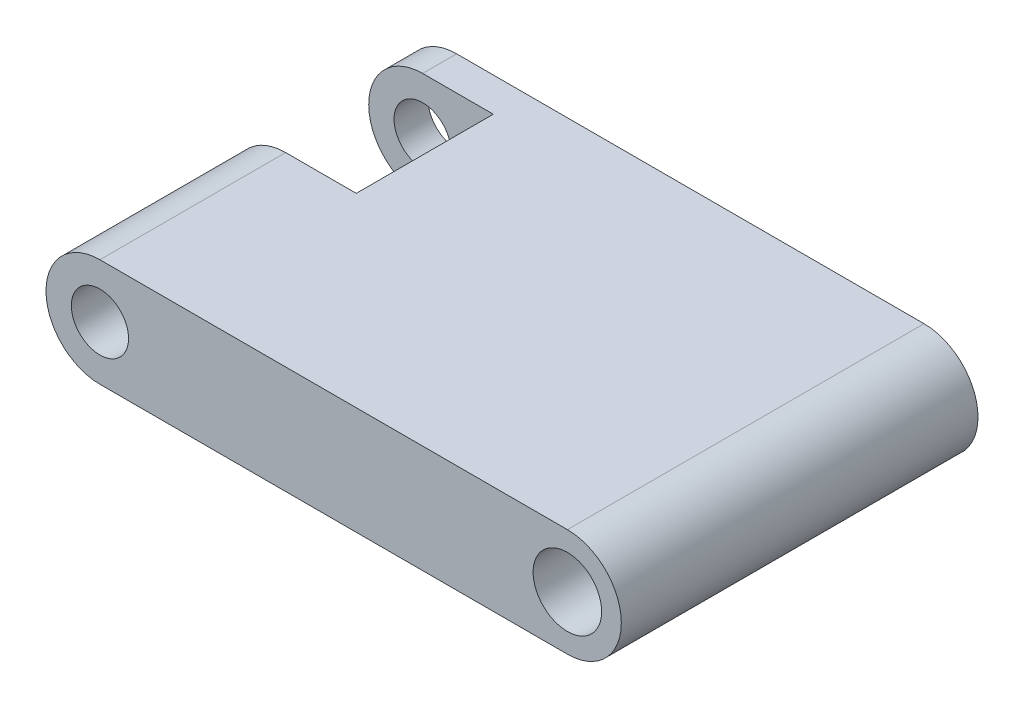
ISO-10303-21;
HEADER;
FILE_DESCRIPTION(('STEP AP214'),'2;1');
FILE_NAME('part.step','',(''),(''),'','','');
FILE_SCHEMA(('AUTOMOTIVE_DESIGN { 1 0 10303 214 1 1 1 1 }'));
ENDSEC;
DATA;
#1=APPLICATION_CONTEXT('core data for automotive mechanical design processes');
#2=APPLICATION_PROTOCOL_DEFINITION('international standard','automotive_design',2000,#1);
#3=PRODUCT_CONTEXT('',#1,'mechanical');
#4=PRODUCT('Part','Part','',(#3));
#5=PRODUCT_RELATED_PRODUCT_CATEGORY('part','',(#4));
#6=PRODUCT_DEFINITION_FORMATION('','',#4);
#7=PRODUCT_DEFINITION_CONTEXT('part definition',#1,'design');
#8=PRODUCT_DEFINITION('design','',#6,#7);
#9=PRODUCT_DEFINITION_SHAPE('','',#8);
#10=(LENGTH_UNIT() NAMED_UNIT(*) SI_UNIT(.MILLI.,.METRE.));
#11=(NAMED_UNIT(*) PLANE_ANGLE_UNIT() SI_UNIT($,.RADIAN.));
#12=(NAMED_UNIT(*) SI_UNIT($,.STERADIAN.) SOLID_ANGLE_UNIT());
#13=UNCERTAINTY_MEASURE_WITH_UNIT(LENGTH_MEASURE(1.E-05),#10,'distance_accuracy_value','');
#14=(GEOMETRIC_REPRESENTATION_CONTEXT(3) GLOBAL_UNCERTAINTY_ASSIGNED_CONTEXT((#13)) GLOBAL_UNIT_ASSIGNED_CONTEXT((#10,
#11,#12)) REPRESENTATION_CONTEXT('',''));
#15=CARTESIAN_POINT('',(0.,0.,0.));
#16=DIRECTION('',(0.,0.,1.));
#17=DIRECTION('',(1.,0.,0.));
#18=AXIS2_PLACEMENT_3D('',#15,#16,#17);
#19=CARTESIAN_POINT('',(-20.6375,0.,15.748));
#20=DIRECTION('',(0.,0.,-1.));
#21=DIRECTION('',(-1.,0.,0.));
#22=AXIS2_PLACEMENT_3D('',#19,#20,#21);
#23=CYLINDRICAL_SURFACE('',#22,4.76249999999999);
#24=CARTESIAN_POINT('',(-20.6375,0.,-12.748));
#25=DIRECTION('',(0.,0.,-1.));
#26=DIRECTION('',(-1.,0.,0.));
#27=AXIS2_PLACEMENT_3D('',#24,#25,#26);
#28=CIRCLE('',#27,4.76249999999999);
#29=CARTESIAN_POINT('',(-20.6375,-4.76249999999999,-12.748));
#30=VERTEX_POINT('',#29);
#31=CARTESIAN_POINT('',(-20.6375,4.76249999999999,-12.748));
#32=VERTEX_POINT('',#31);
#33=EDGE_CURVE('E148',#30,#32,#28,.T.);
#34=ORIENTED_EDGE('',*,*,#33,.T.);
#35=DIRECTION('',(0.,0.,-1.));
#36=VECTOR('',#35,1.);
#37=CARTESIAN_POINT('',(-20.6375,4.76249999999999,15.748));
#38=LINE('',#37,#36);
#39=CARTESIAN_POINT('',(-20.6375,4.76249999999999,-15.748));
#40=VERTEX_POINT('',#39);
#41=EDGE_CURVE('E86',#32,#40,#38,.T.);
#42=ORIENTED_EDGE('',*,*,#41,.T.);
#43=CARTESIAN_POINT('',(-20.6375,0.,-15.748));
#44=DIRECTION('',(0.,0.,1.));
#45=DIRECTION('',(1.,0.,0.));
#46=AXIS2_PLACEMENT_3D('',#43,#44,#45);
#47=CIRCLE('',#46,4.76249999999999);
#48=CARTESIAN_POINT('',(-20.6375,-4.76249999999999,-15.748));
#49=VERTEX_POINT('',#48);
#50=EDGE_CURVE('E165',#40,#49,#47,.T.);
#51=ORIENTED_EDGE('',*,*,#50,.T.);
#52=DIRECTION('',(0.,0.,-1.));
#53=VECTOR('',#52,1.);
#54=CARTESIAN_POINT('',(-20.6375,-4.76249999999999,15.748));
#55=LINE('',#54,#53);
#56=EDGE_CURVE('E202',#30,#49,#55,.T.);
#57=ORIENTED_EDGE('',*,*,#56,.F.);
#58=EDGE_LOOP('',(#34,#42,#51,#57));
#59=FACE_BOUND('',#58,.T.);
#60=ADVANCED_FACE('F39',(#59),#23,.T.);
#61=CARTESIAN_POINT('',(-20.6375,0.,15.748));
#62=DIRECTION('',(0.,0.,-1.));
#63=DIRECTION('',(-1.,0.,0.));
#64=AXIS2_PLACEMENT_3D('',#61,#62,#63);
#65=CYLINDRICAL_SURFACE('',#64,2.525);
#66=CARTESIAN_POINT('',(-20.6375,0.,-12.748));
#67=DIRECTION('',(0.,0.,-1.));
#68=DIRECTION('',(-1.,0.,0.));
#69=AXIS2_PLACEMENT_3D('',#66,#67,#68);
#70=CIRCLE('',#69,2.525);
#71=CARTESIAN_POINT('',(-23.1625,0.,-12.748));
#72=VERTEX_POINT('',#71);
#73=EDGE_CURVE('E136',#72,#72,#70,.T.);
#74=ORIENTED_EDGE('',*,*,#73,.F.);
#75=EDGE_LOOP('',(#74));
#76=FACE_BOUND('',#75,.T.);
#77=CARTESIAN_POINT('',(-20.6375,0.,-15.748));
#78=DIRECTION('',(0.,0.,1.));
#79=DIRECTION('',(1.,0.,0.));
#80=AXIS2_PLACEMENT_3D('',#77,#78,#79);
#81=CIRCLE('',#80,2.525);
#82=CARTESIAN_POINT('',(-18.1125,0.,-15.748));
#83=VERTEX_POINT('',#82);
#84=EDGE_CURVE('E157',#83,#83,#81,.T.);
#85=ORIENTED_EDGE('',*,*,#84,.F.);
#86=EDGE_LOOP('',(#85));
#87=FACE_BOUND('',#86,.T.);
#88=ADVANCED_FACE('F229',(#76,#87),#65,.F.);
#89=CARTESIAN_POINT('',(-20.6375,0.,15.748));
#90=DIRECTION('',(0.,0.,1.));
#91=DIRECTION('',(1.,0.,0.));
#92=AXIS2_PLACEMENT_3D('',#89,#90,#91);
#93=PLANE('',#92);
#94=CARTESIAN_POINT('',(-20.6375,0.,15.748));
#95=DIRECTION('',(0.,0.,1.));
#96=DIRECTION('',(1.,0.,0.));
#97=AXIS2_PLACEMENT_3D('',#94,#95,#96);
#98=CIRCLE('',#97,2.525);
#99=CARTESIAN_POINT('',(-18.1125,0.,15.748));
#100=VERTEX_POINT('',#99);
#101=EDGE_CURVE('E161',#100,#100,#98,.T.);
#102=ORIENTED_EDGE('',*,*,#101,.F.);
#103=EDGE_LOOP('',(#102));
#104=FACE_BOUND('',#103,.T.);
#105=CARTESIAN_POINT('',(-20.6375,0.,15.748));
#106=DIRECTION('',(0.,0.,1.));
#107=DIRECTION('',(1.,0.,0.));
#108=AXIS2_PLACEMENT_3D('',#105,#106,#107);
#109=CIRCLE('',#108,4.76249999999999);
#110=CARTESIAN_POINT('',(-20.6375,4.76249999999999,15.748));
#111=VERTEX_POINT('',#110);
#112=CARTESIAN_POINT('',(-20.6375,-4.76249999999999,15.748));
#113=VERTEX_POINT('',#112);
#114=EDGE_CURVE('E169',#111,#113,#109,.T.);
#115=ORIENTED_EDGE('',*,*,#114,.T.);
#116=DIRECTION('',(1.,0.,0.));
#117=VECTOR('',#116,1.);
#118=CARTESIAN_POINT('',(-20.6375,-4.76249999999999,15.748));
#119=LINE('',#118,#117);
#120=CARTESIAN_POINT('',(20.6375,-4.76249999999999,15.748));
#121=VERTEX_POINT('',#120);
#122=EDGE_CURVE('E94',#113,#121,#119,.T.);
#123=ORIENTED_EDGE('',*,*,#122,.T.);
#124=CARTESIAN_POINT('',(20.6375,0.,15.748));
#125=DIRECTION('',(0.,0.,1.));
#126=DIRECTION('',(1.,0.,0.));
#127=AXIS2_PLACEMENT_3D('',#124,#125,#126);
#128=CIRCLE('',#127,4.76249999999999);
#129=CARTESIAN_POINT('',(20.6375,4.76249999999999,15.748));
#130=VERTEX_POINT('',#129);
#131=EDGE_CURVE('E175',#121,#130,#128,.T.);
#132=ORIENTED_EDGE('',*,*,#131,.T.);
#133=DIRECTION('',(-1.,0.,0.));
#134=VECTOR('',#133,1.);
#135=CARTESIAN_POINT('',(-20.6375,4.76249999999999,15.748));
#136=LINE('',#135,#134);
#137=EDGE_CURVE('E64',#130,#111,#136,.T.);
#138=ORIENTED_EDGE('',*,*,#137,.T.);
#139=EDGE_LOOP('',(#115,#123,#132,#138));
#140=FACE_BOUND('',#139,.T.);
#141=CARTESIAN_POINT('',(20.6375,0.,15.748));
#142=DIRECTION('',(0.,0.,1.));
#143=DIRECTION('',(1.,0.,0.));
#144=AXIS2_PLACEMENT_3D('',#141,#142,#143);
#145=CIRCLE('',#144,3.025);
#146=CARTESIAN_POINT('',(23.6625,0.,15.748));
#147=VERTEX_POINT('',#146);
#148=EDGE_CURVE('E153',#147,#147,#145,.T.);
#149=ORIENTED_EDGE('',*,*,#148,.F.);
#150=EDGE_LOOP('',(#149));
#151=FACE_BOUND('',#150,.T.);
#152=ADVANCED_FACE('F233',(#104,#140,#151),#93,.T.);
#153=CARTESIAN_POINT('',(-20.6375,0.,-15.748));
#154=DIRECTION('',(0.,0.,1.));
#155=DIRECTION('',(1.,0.,0.));
#156=AXIS2_PLACEMENT_3D('',#153,#154,#155);
#157=PLANE('',#156);
#158=ORIENTED_EDGE('',*,*,#50,.F.);
#159=DIRECTION('',(-1.,0.,0.));
#160=VECTOR('',#159,1.);
#161=CARTESIAN_POINT('',(-20.6375,4.76249999999999,-15.748));
#162=LINE('',#161,#160);
#163=CARTESIAN_POINT('',(20.6375,4.76249999999999,-15.748));
#164=VERTEX_POINT('',#163);
#165=EDGE_CURVE('E172',#164,#40,#162,.T.);
#166=ORIENTED_EDGE('',*,*,#165,.F.);
#167=CARTESIAN_POINT('',(20.6375,0.,-15.748));
#168=DIRECTION('',(0.,0.,1.));
#169=DIRECTION('',(1.,0.,0.));
#170=AXIS2_PLACEMENT_3D('',#167,#168,#169);
#171=CIRCLE('',#170,4.76249999999999);
#172=CARTESIAN_POINT('',(20.6375,-4.76249999999999,-15.748));
#173=VERTEX_POINT('',#172);
#174=EDGE_CURVE('E185',#173,#164,#171,.T.);
#175=ORIENTED_EDGE('',*,*,#174,.F.);
#176=DIRECTION('',(1.,0.,0.));
#177=VECTOR('',#176,1.);
#178=CARTESIAN_POINT('',(-20.6375,-4.76249999999999,-15.748));
#179=LINE('',#178,#177);
#180=EDGE_CURVE('E182',#49,#173,#179,.T.);
#181=ORIENTED_EDGE('',*,*,#180,.F.);
#182=EDGE_LOOP('',(#158,#166,#175,#181));
#183=FACE_BOUND('',#182,.T.);
#184=ORIENTED_EDGE('',*,*,#84,.T.);
#185=EDGE_LOOP('',(#184));
#186=FACE_BOUND('',#185,.T.);
#187=CARTESIAN_POINT('',(20.6375,0.,-15.748));
#188=DIRECTION('',(0.,0.,1.));
#189=DIRECTION('',(1.,0.,0.));
#190=AXIS2_PLACEMENT_3D('',#187,#188,#189);
#191=CIRCLE('',#190,3.025);
#192=CARTESIAN_POINT('',(23.6625,0.,-15.748));
#193=VERTEX_POINT('',#192);
#194=EDGE_CURVE('E125',#193,#193,#191,.T.);
#195=ORIENTED_EDGE('',*,*,#194,.T.);
#196=EDGE_LOOP('',(#195));
#197=FACE_BOUND('',#196,.T.);
#198=ADVANCED_FACE('F226',(#183,#186,#197),#157,.F.);
#199=CARTESIAN_POINT('',(-20.6375,4.76249999999999,-0.647999999999999));
#200=VERTEX_POINT('',#199);
#201=EDGE_CURVE('E190',#111,#200,#38,.T.);
#202=ORIENTED_EDGE('',*,*,#201,.T.);
#203=CARTESIAN_POINT('',(-20.6375,0.,-0.647999999999999));
#204=DIRECTION('',(0.,0.,1.));
#205=DIRECTION('',(1.,0.,0.));
#206=AXIS2_PLACEMENT_3D('',#203,#204,#205);
#207=CIRCLE('',#206,4.76249999999999);
#208=CARTESIAN_POINT('',(-20.6375,-4.76249999999999,-0.647999999999999));
#209=VERTEX_POINT('',#208);
#210=EDGE_CURVE('E55',#200,#209,#207,.T.);
#211=ORIENTED_EDGE('',*,*,#210,.T.);
#212=EDGE_CURVE('E48',#113,#209,#55,.T.);
#213=ORIENTED_EDGE('',*,*,#212,.F.);
#214=ORIENTED_EDGE('',*,*,#114,.F.);
#215=EDGE_LOOP('',(#202,#211,#213,#214));
#216=FACE_BOUND('',#215,.T.);
#217=ADVANCED_FACE('F41',(#216),#23,.T.);
#218=CARTESIAN_POINT('',(-20.6375,-4.76249999999999,15.748));
#219=DIRECTION('',(0.,1.,0.));
#220=DIRECTION('',(0.,0.,1.));
#221=AXIS2_PLACEMENT_3D('',#218,#219,#220);
#222=PLANE('',#221);
#223=DIRECTION('',(0.,0.,-1.));
#224=VECTOR('',#223,1.);
#225=CARTESIAN_POINT('',(-14.4,-4.76249999999999,15.748));
#226=LINE('',#225,#224);
#227=CARTESIAN_POINT('',(-14.4,-4.7625,-0.647999999999999));
#228=VERTEX_POINT('',#227);
#229=CARTESIAN_POINT('',(-14.4,-4.7625,-12.748));
#230=VERTEX_POINT('',#229);
#231=EDGE_CURVE('E116',#228,#230,#226,.T.);
#232=ORIENTED_EDGE('',*,*,#231,.T.);
#233=DIRECTION('',(-1.,0.,0.));
#234=VECTOR('',#233,1.);
#235=CARTESIAN_POINT('',(-20.6375,-4.76249999999999,-12.748));
#236=LINE('',#235,#234);
#237=EDGE_CURVE('E126',#230,#30,#236,.T.);
#238=ORIENTED_EDGE('',*,*,#237,.T.);
#239=ORIENTED_EDGE('',*,*,#56,.T.);
#240=ORIENTED_EDGE('',*,*,#180,.T.);
#241=DIRECTION('',(0.,0.,-1.));
#242=VECTOR('',#241,1.);
#243=CARTESIAN_POINT('',(20.6375,-4.76249999999999,15.748));
#244=LINE('',#243,#242);
#245=EDGE_CURVE('E198',#121,#173,#244,.T.);
#246=ORIENTED_EDGE('',*,*,#245,.F.);
#247=ORIENTED_EDGE('',*,*,#122,.F.);
#248=ORIENTED_EDGE('',*,*,#212,.T.);
#249=DIRECTION('',(1.,0.,0.));
#250=VECTOR('',#249,1.);
#251=CARTESIAN_POINT('',(-20.6375,-4.76249999999999,-0.647999999999999));
#252=LINE('',#251,#250);
#253=EDGE_CURVE('E129',#209,#228,#252,.T.);
#254=ORIENTED_EDGE('',*,*,#253,.T.);
#255=EDGE_LOOP('',(#232,#238,#239,#240,#246,#247,#248,#254));
#256=FACE_BOUND('',#255,.T.);
#257=ADVANCED_FACE('F133',(#256),#222,.F.);
#258=CARTESIAN_POINT('',(20.6375,0.,15.748));
#259=DIRECTION('',(0.,0.,-1.));
#260=DIRECTION('',(-1.,0.,0.));
#261=AXIS2_PLACEMENT_3D('',#258,#259,#260);
#262=CYLINDRICAL_SURFACE('',#261,4.76249999999999);
#263=ORIENTED_EDGE('',*,*,#174,.T.);
#264=DIRECTION('',(0.,0.,-1.));
#265=VECTOR('',#264,1.);
#266=CARTESIAN_POINT('',(20.6375,4.76249999999999,15.748));
#267=LINE('',#266,#265);
#268=EDGE_CURVE('E194',#130,#164,#267,.T.);
#269=ORIENTED_EDGE('',*,*,#268,.F.);
#270=ORIENTED_EDGE('',*,*,#131,.F.);
#271=ORIENTED_EDGE('',*,*,#245,.T.);
#272=EDGE_LOOP('',(#263,#269,#270,#271));
#273=FACE_BOUND('',#272,.T.);
#274=ADVANCED_FACE('F243',(#273),#262,.T.);
#275=CARTESIAN_POINT('',(-20.6375,4.76249999999999,15.748));
#276=DIRECTION('',(0.,-1.,0.));
#277=DIRECTION('',(0.,0.,-1.));
#278=AXIS2_PLACEMENT_3D('',#275,#276,#277);
#279=PLANE('',#278);
#280=ORIENTED_EDGE('',*,*,#41,.F.);
#281=DIRECTION('',(1.,0.,0.));
#282=VECTOR('',#281,1.);
#283=CARTESIAN_POINT('',(-20.6375,4.76249999999999,-12.748));
#284=LINE('',#283,#282);
#285=CARTESIAN_POINT('',(-14.4,4.7625,-12.748));
#286=VERTEX_POINT('',#285);
#287=EDGE_CURVE('E141',#32,#286,#284,.T.);
#288=ORIENTED_EDGE('',*,*,#287,.T.);
#289=DIRECTION('',(0.,0.,1.));
#290=VECTOR('',#289,1.);
#291=CARTESIAN_POINT('',(-14.4,4.76249999999999,15.748));
#292=LINE('',#291,#290);
#293=CARTESIAN_POINT('',(-14.4,4.7625,-0.647999999999999));
#294=VERTEX_POINT('',#293);
#295=EDGE_CURVE('E11',#286,#294,#292,.T.);
#296=ORIENTED_EDGE('',*,*,#295,.T.);
#297=DIRECTION('',(-1.,0.,0.));
#298=VECTOR('',#297,1.);
#299=CARTESIAN_POINT('',(-20.6375,4.76249999999999,-0.647999999999999));
#300=LINE('',#299,#298);
#301=EDGE_CURVE('E130',#294,#200,#300,.T.);
#302=ORIENTED_EDGE('',*,*,#301,.T.);
#303=ORIENTED_EDGE('',*,*,#201,.F.);
#304=ORIENTED_EDGE('',*,*,#137,.F.);
#305=ORIENTED_EDGE('',*,*,#268,.T.);
#306=ORIENTED_EDGE('',*,*,#165,.T.);
#307=EDGE_LOOP('',(#280,#288,#296,#302,#303,#304,#305,#306));
#308=FACE_BOUND('',#307,.T.);
#309=ADVANCED_FACE('F217',(#308),#279,.F.);
#310=CARTESIAN_POINT('',(-20.6375,0.,-0.647999999999999));
#311=DIRECTION('',(0.,0.,1.));
#312=DIRECTION('',(1.,0.,0.));
#313=AXIS2_PLACEMENT_3D('',#310,#311,#312);
#314=CIRCLE('',#313,2.525);
#315=CARTESIAN_POINT('',(-18.1125,0.,-0.647999999999999));
#316=VERTEX_POINT('',#315);
#317=EDGE_CURVE('E205',#316,#316,#314,.T.);
#318=ORIENTED_EDGE('',*,*,#317,.F.);
#319=EDGE_LOOP('',(#318));
#320=FACE_BOUND('',#319,.T.);
#321=ORIENTED_EDGE('',*,*,#101,.T.);
#322=EDGE_LOOP('',(#321));
#323=FACE_BOUND('',#322,.T.);
#324=ADVANCED_FACE('F236',(#320,#323),#65,.F.);
#325=CARTESIAN_POINT('',(20.6375,0.,15.748));
#326=DIRECTION('',(0.,0.,-1.));
#327=DIRECTION('',(-1.,0.,0.));
#328=AXIS2_PLACEMENT_3D('',#325,#326,#327);
#329=CYLINDRICAL_SURFACE('',#328,3.025);
#330=ORIENTED_EDGE('',*,*,#148,.T.);
#331=EDGE_LOOP('',(#330));
#332=FACE_BOUND('',#331,.T.);
#333=ORIENTED_EDGE('',*,*,#194,.F.);
#334=EDGE_LOOP('',(#333));
#335=FACE_BOUND('',#334,.T.);
#336=ADVANCED_FACE('F255',(#332,#335),#329,.F.);
#337=CARTESIAN_POINT('',(-14.4,-12.7,-0.647999999999999));
#338=DIRECTION('',(1.,0.,0.));
#339=DIRECTION('',(0.,0.,-1.));
#340=AXIS2_PLACEMENT_3D('',#337,#338,#339);
#341=PLANE('',#340);
#342=DIRECTION('',(0.,1.,0.));
#343=VECTOR('',#342,1.);
#344=CARTESIAN_POINT('',(-14.4,-12.7,-0.647999999999999));
#345=LINE('',#344,#343);
#346=EDGE_CURVE('E119',#228,#294,#345,.T.);
#347=ORIENTED_EDGE('',*,*,#346,.T.);
#348=ORIENTED_EDGE('',*,*,#295,.F.);
#349=DIRECTION('',(0.,1.,0.));
#350=VECTOR('',#349,1.);
#351=CARTESIAN_POINT('',(-14.4,-12.7,-12.748));
#352=LINE('',#351,#350);
#353=EDGE_CURVE('E121',#230,#286,#352,.T.);
#354=ORIENTED_EDGE('',*,*,#353,.F.);
#355=ORIENTED_EDGE('',*,*,#231,.F.);
#356=EDGE_LOOP('',(#347,#348,#354,#355));
#357=FACE_BOUND('',#356,.T.);
#358=ADVANCED_FACE('F118',(#357),#341,.F.);
#359=CARTESIAN_POINT('',(-14.4,-12.7,-12.748));
#360=DIRECTION('',(0.,0.,-1.));
#361=DIRECTION('',(-1.,0.,0.));
#362=AXIS2_PLACEMENT_3D('',#359,#360,#361);
#363=PLANE('',#362);
#364=ORIENTED_EDGE('',*,*,#73,.T.);
#365=EDGE_LOOP('',(#364));
#366=FACE_BOUND('',#365,.T.);
#367=ORIENTED_EDGE('',*,*,#353,.T.);
#368=ORIENTED_EDGE('',*,*,#287,.F.);
#369=ORIENTED_EDGE('',*,*,#33,.F.);
#370=ORIENTED_EDGE('',*,*,#237,.F.);
#371=EDGE_LOOP('',(#367,#368,#369,#370));
#372=FACE_BOUND('',#371,.T.);
#373=ADVANCED_FACE('F215',(#366,#372),#363,.F.);
#374=CARTESIAN_POINT('',(-14.4,-12.7,-0.647999999999999));
#375=DIRECTION('',(0.,0.,1.));
#376=DIRECTION('',(1.,0.,0.));
#377=AXIS2_PLACEMENT_3D('',#374,#375,#376);
#378=PLANE('',#377);
#379=ORIENTED_EDGE('',*,*,#317,.T.);
#380=EDGE_LOOP('',(#379));
#381=FACE_BOUND('',#380,.T.);
#382=ORIENTED_EDGE('',*,*,#210,.F.);
#383=ORIENTED_EDGE('',*,*,#301,.F.);
#384=ORIENTED_EDGE('',*,*,#346,.F.);
#385=ORIENTED_EDGE('',*,*,#253,.F.);
#386=EDGE_LOOP('',(#382,#383,#384,#385));
#387=FACE_BOUND('',#386,.T.);
#388=ADVANCED_FACE('F128',(#381,#387),#378,.F.);
#389=CLOSED_SHELL('',(#60,#88,#152,#198,#217,#257,#274,#309,#324,#336,#358,#373,#388));
#390=MANIFOLD_SOLID_BREP('B2',#389);
#391=ADVANCED_BREP_SHAPE_REPRESENTATION('',(#18,#390),#14);
#392=SHAPE_DEFINITION_REPRESENTATION(#9,#391);
ENDSEC;
END-ISO-10303-21;
